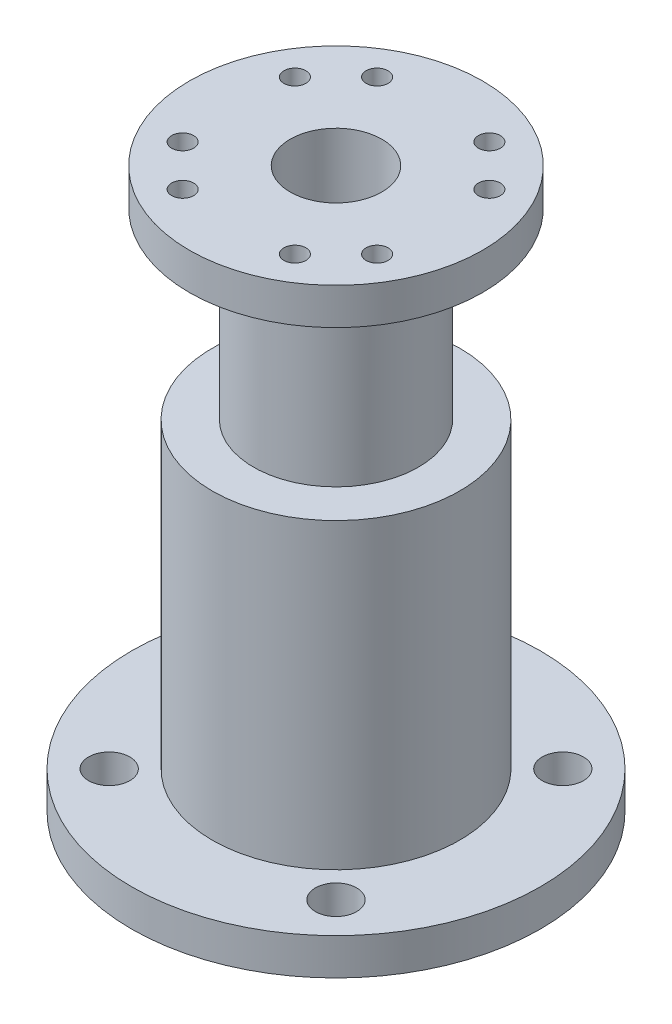
ISO-10303-21;
HEADER;
FILE_DESCRIPTION(('STEP AP214'),'2;1');
FILE_NAME('part.step','',(''),(''),'','','');
FILE_SCHEMA(('AUTOMOTIVE_DESIGN { 1 0 10303 214 1 1 1 1 }'));
ENDSEC;
DATA;
#1=APPLICATION_CONTEXT('core data for automotive mechanical design processes');
#2=APPLICATION_PROTOCOL_DEFINITION('international standard','automotive_design',2000,#1);
#3=PRODUCT_CONTEXT('',#1,'mechanical');
#4=PRODUCT('Part','Part','',(#3));
#5=PRODUCT_RELATED_PRODUCT_CATEGORY('part','',(#4));
#6=PRODUCT_DEFINITION_FORMATION('','',#4);
#7=PRODUCT_DEFINITION_CONTEXT('part definition',#1,'design');
#8=PRODUCT_DEFINITION('design','',#6,#7);
#9=PRODUCT_DEFINITION_SHAPE('','',#8);
#10=(LENGTH_UNIT() NAMED_UNIT(*) SI_UNIT(.MILLI.,.METRE.));
#11=(NAMED_UNIT(*) PLANE_ANGLE_UNIT() SI_UNIT($,.RADIAN.));
#12=(NAMED_UNIT(*) SI_UNIT($,.STERADIAN.) SOLID_ANGLE_UNIT());
#13=UNCERTAINTY_MEASURE_WITH_UNIT(LENGTH_MEASURE(1.E-05),#10,'distance_accuracy_value','');
#14=(GEOMETRIC_REPRESENTATION_CONTEXT(3) GLOBAL_UNCERTAINTY_ASSIGNED_CONTEXT((#13)) GLOBAL_UNIT_ASSIGNED_CONTEXT((#10,
#11,#12)) REPRESENTATION_CONTEXT('',''));
#15=CARTESIAN_POINT('',(0.,0.,0.));
#16=DIRECTION('',(0.,0.,1.));
#17=DIRECTION('',(1.,0.,0.));
#18=AXIS2_PLACEMENT_3D('',#15,#16,#17);
#19=CARTESIAN_POINT('',(0.,0.,0.));
#20=DIRECTION('',(0.,-1.,0.));
#21=DIRECTION('',(0.,0.,-1.));
#22=AXIS2_PLACEMENT_3D('',#19,#20,#21);
#23=CYLINDRICAL_SURFACE('',#22,9.);
#24=CARTESIAN_POINT('',(0.,37.,0.));
#25=DIRECTION('',(0.,-1.,0.));
#26=DIRECTION('',(0.,0.,-1.));
#27=AXIS2_PLACEMENT_3D('',#24,#25,#26);
#28=CIRCLE('',#27,9.00000000000001);
#29=CARTESIAN_POINT('',(0.,37.,-9.00000000000001));
#30=VERTEX_POINT('',#29);
#31=EDGE_CURVE('E41',#30,#30,#28,.T.);
#32=ORIENTED_EDGE('',*,*,#31,.F.);
#33=EDGE_LOOP('',(#32));
#34=FACE_BOUND('',#33,.T.);
#35=CARTESIAN_POINT('',(0.,57.,0.));
#36=DIRECTION('',(0.,1.,0.));
#37=DIRECTION('',(0.,0.,1.));
#38=AXIS2_PLACEMENT_3D('',#35,#36,#37);
#39=CIRCLE('',#38,9.);
#40=CARTESIAN_POINT('',(0.,57.,9.));
#41=VERTEX_POINT('',#40);
#42=EDGE_CURVE('E99',#41,#41,#39,.T.);
#43=ORIENTED_EDGE('',*,*,#42,.F.);
#44=EDGE_LOOP('',(#43));
#45=FACE_BOUND('',#44,.T.);
#46=ADVANCED_FACE('F28',(#34,#45),#23,.T.);
#47=CARTESIAN_POINT('',(0.,0.,0.));
#48=DIRECTION('',(0.,-1.,0.));
#49=DIRECTION('',(0.,0.,-1.));
#50=AXIS2_PLACEMENT_3D('',#47,#48,#49);
#51=CYLINDRICAL_SURFACE('',#50,13.5);
#52=CARTESIAN_POINT('',(0.,37.,0.));
#53=DIRECTION('',(0.,-1.,0.));
#54=DIRECTION('',(0.,0.,-1.));
#55=AXIS2_PLACEMENT_3D('',#52,#53,#54);
#56=CIRCLE('',#55,13.5);
#57=CARTESIAN_POINT('',(0.,37.,-13.5));
#58=VERTEX_POINT('',#57);
#59=EDGE_CURVE('E36',#58,#58,#56,.T.);
#60=ORIENTED_EDGE('',*,*,#59,.T.);
#61=EDGE_LOOP('',(#60));
#62=FACE_BOUND('',#61,.T.);
#63=CARTESIAN_POINT('',(0.,4.,0.));
#64=DIRECTION('',(0.,-1.,0.));
#65=DIRECTION('',(0.,0.,-1.));
#66=AXIS2_PLACEMENT_3D('',#63,#64,#65);
#67=CIRCLE('',#66,13.5);
#68=CARTESIAN_POINT('',(0.,4.,-13.5));
#69=VERTEX_POINT('',#68);
#70=EDGE_CURVE('E48',#69,#69,#67,.T.);
#71=ORIENTED_EDGE('',*,*,#70,.F.);
#72=EDGE_LOOP('',(#71));
#73=FACE_BOUND('',#72,.T.);
#74=ADVANCED_FACE('F95',(#62,#73),#51,.T.);
#75=CARTESIAN_POINT('',(0.,0.,0.));
#76=DIRECTION('',(0.,-1.,0.));
#77=DIRECTION('',(0.,0.,-1.));
#78=AXIS2_PLACEMENT_3D('',#75,#76,#77);
#79=CYLINDRICAL_SURFACE('',#78,9.5);
#80=CARTESIAN_POINT('',(0.,0.,0.));
#81=DIRECTION('',(0.,-1.,0.));
#82=DIRECTION('',(0.,0.,-1.));
#83=AXIS2_PLACEMENT_3D('',#80,#81,#82);
#84=CIRCLE('',#83,9.50000000000001);
#85=CARTESIAN_POINT('',(0.,0.,-9.50000000000001));
#86=VERTEX_POINT('',#85);
#87=EDGE_CURVE('E10',#86,#86,#84,.T.);
#88=ORIENTED_EDGE('',*,*,#87,.T.);
#89=EDGE_LOOP('',(#88));
#90=FACE_BOUND('',#89,.T.);
#91=CARTESIAN_POINT('',(0.,33.,0.));
#92=DIRECTION('',(0.,-1.,0.));
#93=DIRECTION('',(0.,0.,-1.));
#94=AXIS2_PLACEMENT_3D('',#91,#92,#93);
#95=CIRCLE('',#94,9.5);
#96=CARTESIAN_POINT('',(0.,33.,-9.5));
#97=VERTEX_POINT('',#96);
#98=EDGE_CURVE('E77',#97,#97,#95,.T.);
#99=ORIENTED_EDGE('',*,*,#98,.F.);
#100=EDGE_LOOP('',(#99));
#101=FACE_BOUND('',#100,.T.);
#102=ADVANCED_FACE('F30',(#90,#101),#79,.F.);
#103=CARTESIAN_POINT('',(9.50000000000001,0.,0.));
#104=DIRECTION('',(0.,-1.,0.));
#105=DIRECTION('',(0.,0.,-1.));
#106=AXIS2_PLACEMENT_3D('',#103,#104,#105);
#107=PLANE('',#106);
#108=CARTESIAN_POINT('',(-12.3743686707646,0.,12.3743686707646));
#109=DIRECTION('',(0.,-1.,0.));
#110=DIRECTION('',(0.,0.,-1.));
#111=AXIS2_PLACEMENT_3D('',#108,#109,#110);
#112=CIRCLE('',#111,2.24999999999999);
#113=CARTESIAN_POINT('',(-12.3743686707646,0.,10.1243686707646));
#114=VERTEX_POINT('',#113);
#115=EDGE_CURVE('E65',#114,#114,#112,.T.);
#116=ORIENTED_EDGE('',*,*,#115,.F.);
#117=EDGE_LOOP('',(#116));
#118=FACE_BOUND('',#117,.T.);
#119=CARTESIAN_POINT('',(12.3743686707646,0.,12.3743686707646));
#120=DIRECTION('',(0.,-1.,0.));
#121=DIRECTION('',(0.,0.,-1.));
#122=AXIS2_PLACEMENT_3D('',#119,#120,#121);
#123=CIRCLE('',#122,2.24999999999999);
#124=CARTESIAN_POINT('',(12.3743686707646,0.,10.1243686707646));
#125=VERTEX_POINT('',#124);
#126=EDGE_CURVE('E55',#125,#125,#123,.T.);
#127=ORIENTED_EDGE('',*,*,#126,.F.);
#128=EDGE_LOOP('',(#127));
#129=FACE_BOUND('',#128,.T.);
#130=CARTESIAN_POINT('',(12.3743686707646,0.,-12.3743686707646));
#131=DIRECTION('',(0.,-1.,0.));
#132=DIRECTION('',(0.,0.,-1.));
#133=AXIS2_PLACEMENT_3D('',#130,#131,#132);
#134=CIRCLE('',#133,2.24999999999999);
#135=CARTESIAN_POINT('',(12.3743686707646,0.,-14.6243686707646));
#136=VERTEX_POINT('',#135);
#137=EDGE_CURVE('E52',#136,#136,#134,.T.);
#138=ORIENTED_EDGE('',*,*,#137,.F.);
#139=EDGE_LOOP('',(#138));
#140=FACE_BOUND('',#139,.T.);
#141=CARTESIAN_POINT('',(-12.3743686707646,0.,-12.3743686707646));
#142=DIRECTION('',(0.,-1.,0.));
#143=DIRECTION('',(0.,0.,-1.));
#144=AXIS2_PLACEMENT_3D('',#141,#142,#143);
#145=CIRCLE('',#144,2.24999999999999);
#146=CARTESIAN_POINT('',(-12.3743686707646,0.,-14.6243686707646));
#147=VERTEX_POINT('',#146);
#148=EDGE_CURVE('E49',#147,#147,#145,.T.);
#149=ORIENTED_EDGE('',*,*,#148,.F.);
#150=EDGE_LOOP('',(#149));
#151=FACE_BOUND('',#150,.T.);
#152=ORIENTED_EDGE('',*,*,#87,.F.);
#153=EDGE_LOOP('',(#152));
#154=FACE_BOUND('',#153,.T.);
#155=CARTESIAN_POINT('',(0.,0.,0.));
#156=DIRECTION('',(0.,-1.,0.));
#157=DIRECTION('',(0.,0.,-1.));
#158=AXIS2_PLACEMENT_3D('',#155,#156,#157);
#159=CIRCLE('',#158,22.3);
#160=CARTESIAN_POINT('',(0.,0.,-22.3));
#161=VERTEX_POINT('',#160);
#162=EDGE_CURVE('E73',#161,#161,#159,.T.);
#163=ORIENTED_EDGE('',*,*,#162,.T.);
#164=EDGE_LOOP('',(#163));
#165=FACE_BOUND('',#164,.T.);
#166=ADVANCED_FACE('F120',(#118,#129,#140,#151,#154,#165),#107,.T.);
#167=CARTESIAN_POINT('',(9.00000000000001,37.,0.));
#168=DIRECTION('',(0.,1.,0.));
#169=DIRECTION('',(0.,0.,1.));
#170=AXIS2_PLACEMENT_3D('',#167,#168,#169);
#171=PLANE('',#170);
#172=ORIENTED_EDGE('',*,*,#31,.T.);
#173=EDGE_LOOP('',(#172));
#174=FACE_BOUND('',#173,.T.);
#175=ORIENTED_EDGE('',*,*,#59,.F.);
#176=EDGE_LOOP('',(#175));
#177=FACE_BOUND('',#176,.T.);
#178=ADVANCED_FACE('F90',(#174,#177),#171,.T.);
#179=CARTESIAN_POINT('',(5.,61.,0.));
#180=DIRECTION('',(0.,1.,0.));
#181=DIRECTION('',(0.,0.,1.));
#182=AXIS2_PLACEMENT_3D('',#179,#180,#181);
#183=PLANE('',#182);
#184=CARTESIAN_POINT('',(-10.6088111963593,61.,-6.12500000000004));
#185=DIRECTION('',(0.,1.,0.));
#186=DIRECTION('',(0.,0.,1.));
#187=AXIS2_PLACEMENT_3D('',#184,#185,#186);
#188=CIRCLE('',#187,1.2);
#189=CARTESIAN_POINT('',(-10.6088111963593,61.,-4.92500000000004));
#190=VERTEX_POINT('',#189);
#191=EDGE_CURVE('E328',#190,#190,#188,.T.);
#192=ORIENTED_EDGE('',*,*,#191,.F.);
#193=EDGE_LOOP('',(#192));
#194=FACE_BOUND('',#193,.T.);
#195=CARTESIAN_POINT('',(10.6088111963594,61.,-6.12499999999991));
#196=DIRECTION('',(0.,1.,0.));
#197=DIRECTION('',(0.,0.,1.));
#198=AXIS2_PLACEMENT_3D('',#195,#196,#197);
#199=CIRCLE('',#198,1.2);
#200=CARTESIAN_POINT('',(10.6088111963594,61.,-4.92499999999991));
#201=VERTEX_POINT('',#200);
#202=EDGE_CURVE('E330',#201,#201,#199,.T.);
#203=ORIENTED_EDGE('',*,*,#202,.F.);
#204=EDGE_LOOP('',(#203));
#205=FACE_BOUND('',#204,.T.);
#206=CARTESIAN_POINT('',(6.12499999999994,61.,10.6088111963594));
#207=DIRECTION('',(0.,1.,0.));
#208=DIRECTION('',(0.,0.,1.));
#209=AXIS2_PLACEMENT_3D('',#206,#207,#208);
#210=CIRCLE('',#209,1.2);
#211=CARTESIAN_POINT('',(6.12499999999994,61.,11.8088111963594));
#212=VERTEX_POINT('',#211);
#213=EDGE_CURVE('E338',#212,#212,#210,.T.);
#214=ORIENTED_EDGE('',*,*,#213,.F.);
#215=EDGE_LOOP('',(#214));
#216=FACE_BOUND('',#215,.T.);
#217=CARTESIAN_POINT('',(-6.12500000000001,61.,10.6088111963594));
#218=DIRECTION('',(0.,1.,0.));
#219=DIRECTION('',(0.,0.,1.));
#220=AXIS2_PLACEMENT_3D('',#217,#218,#219);
#221=CIRCLE('',#220,1.2);
#222=CARTESIAN_POINT('',(-6.12500000000001,61.,11.8088111963594));
#223=VERTEX_POINT('',#222);
#224=EDGE_CURVE('E344',#223,#223,#221,.T.);
#225=ORIENTED_EDGE('',*,*,#224,.F.);
#226=EDGE_LOOP('',(#225));
#227=FACE_BOUND('',#226,.T.);
#228=CARTESIAN_POINT('',(-10.6088111963594,61.,6.12499999999991));
#229=DIRECTION('',(0.,1.,0.));
#230=DIRECTION('',(0.,0.,1.));
#231=AXIS2_PLACEMENT_3D('',#228,#229,#230);
#232=CIRCLE('',#231,1.2);
#233=CARTESIAN_POINT('',(-10.6088111963594,61.,7.32499999999991));
#234=VERTEX_POINT('',#233);
#235=EDGE_CURVE('E350',#234,#234,#232,.T.);
#236=ORIENTED_EDGE('',*,*,#235,.F.);
#237=EDGE_LOOP('',(#236));
#238=FACE_BOUND('',#237,.T.);
#239=CARTESIAN_POINT('',(-6.12499999999994,61.,-10.6088111963594));
#240=DIRECTION('',(0.,1.,0.));
#241=DIRECTION('',(0.,0.,1.));
#242=AXIS2_PLACEMENT_3D('',#239,#240,#241);
#243=CIRCLE('',#242,1.2);
#244=CARTESIAN_POINT('',(-6.12499999999994,61.,-9.40881119635941));
#245=VERTEX_POINT('',#244);
#246=EDGE_CURVE('E356',#245,#245,#243,.T.);
#247=ORIENTED_EDGE('',*,*,#246,.F.);
#248=EDGE_LOOP('',(#247));
#249=FACE_BOUND('',#248,.T.);
#250=CARTESIAN_POINT('',(6.12500000000001,61.,-10.6088111963594));
#251=DIRECTION('',(0.,1.,0.));
#252=DIRECTION('',(0.,0.,1.));
#253=AXIS2_PLACEMENT_3D('',#250,#251,#252);
#254=CIRCLE('',#253,1.2);
#255=CARTESIAN_POINT('',(6.12500000000001,61.,-9.40881119635937));
#256=VERTEX_POINT('',#255);
#257=EDGE_CURVE('E362',#256,#256,#254,.T.);
#258=ORIENTED_EDGE('',*,*,#257,.F.);
#259=EDGE_LOOP('',(#258));
#260=FACE_BOUND('',#259,.T.);
#261=CARTESIAN_POINT('',(10.6088111963593,61.,6.12500000000004));
#262=DIRECTION('',(0.,1.,0.));
#263=DIRECTION('',(0.,0.,1.));
#264=AXIS2_PLACEMENT_3D('',#261,#262,#263);
#265=CIRCLE('',#264,1.2);
#266=CARTESIAN_POINT('',(10.6088111963593,61.,7.32500000000004));
#267=VERTEX_POINT('',#266);
#268=EDGE_CURVE('E107',#267,#267,#265,.T.);
#269=ORIENTED_EDGE('',*,*,#268,.F.);
#270=EDGE_LOOP('',(#269));
#271=FACE_BOUND('',#270,.T.);
#272=CARTESIAN_POINT('',(0.,61.,0.));
#273=DIRECTION('',(0.,-1.,0.));
#274=DIRECTION('',(0.,0.,-1.));
#275=AXIS2_PLACEMENT_3D('',#272,#273,#274);
#276=CIRCLE('',#275,5.);
#277=CARTESIAN_POINT('',(0.,61.,-5.));
#278=VERTEX_POINT('',#277);
#279=EDGE_CURVE('E85',#278,#278,#276,.T.);
#280=ORIENTED_EDGE('',*,*,#279,.T.);
#281=EDGE_LOOP('',(#280));
#282=FACE_BOUND('',#281,.T.);
#283=CARTESIAN_POINT('',(0.,61.,0.));
#284=DIRECTION('',(0.,1.,0.));
#285=DIRECTION('',(0.,0.,1.));
#286=AXIS2_PLACEMENT_3D('',#283,#284,#285);
#287=CIRCLE('',#286,16.);
#288=CARTESIAN_POINT('',(0.,61.,16.));
#289=VERTEX_POINT('',#288);
#290=EDGE_CURVE('E101',#289,#289,#287,.T.);
#291=ORIENTED_EDGE('',*,*,#290,.T.);
#292=EDGE_LOOP('',(#291));
#293=FACE_BOUND('',#292,.T.);
#294=ADVANCED_FACE('F151',(#194,#205,#216,#227,#238,#249,#260,#271,#282,#293),#183,.T.);
#295=CARTESIAN_POINT('',(0.,0.,0.));
#296=DIRECTION('',(0.,-1.,0.));
#297=DIRECTION('',(0.,0.,-1.));
#298=AXIS2_PLACEMENT_3D('',#295,#296,#297);
#299=CYLINDRICAL_SURFACE('',#298,5.);
#300=CARTESIAN_POINT('',(0.,33.,0.));
#301=DIRECTION('',(0.,-1.,0.));
#302=DIRECTION('',(0.,0.,-1.));
#303=AXIS2_PLACEMENT_3D('',#300,#301,#302);
#304=CIRCLE('',#303,5.);
#305=CARTESIAN_POINT('',(0.,33.,-5.));
#306=VERTEX_POINT('',#305);
#307=EDGE_CURVE('E82',#306,#306,#304,.T.);
#308=ORIENTED_EDGE('',*,*,#307,.T.);
#309=EDGE_LOOP('',(#308));
#310=FACE_BOUND('',#309,.T.);
#311=ORIENTED_EDGE('',*,*,#279,.F.);
#312=EDGE_LOOP('',(#311));
#313=FACE_BOUND('',#312,.T.);
#314=ADVANCED_FACE('F144',(#310,#313),#299,.F.);
#315=CARTESIAN_POINT('',(5.,33.,0.));
#316=DIRECTION('',(0.,-1.,0.));
#317=DIRECTION('',(0.,0.,-1.));
#318=AXIS2_PLACEMENT_3D('',#315,#316,#317);
#319=PLANE('',#318);
#320=ORIENTED_EDGE('',*,*,#98,.T.);
#321=EDGE_LOOP('',(#320));
#322=FACE_BOUND('',#321,.T.);
#323=ORIENTED_EDGE('',*,*,#307,.F.);
#324=EDGE_LOOP('',(#323));
#325=FACE_BOUND('',#324,.T.);
#326=ADVANCED_FACE('F134',(#322,#325),#319,.T.);
#327=CARTESIAN_POINT('',(0.,4.,0.));
#328=DIRECTION('',(0.,-1.,0.));
#329=DIRECTION('',(0.,0.,-1.));
#330=AXIS2_PLACEMENT_3D('',#327,#328,#329);
#331=CYLINDRICAL_SURFACE('',#330,22.3);
#332=CARTESIAN_POINT('',(0.,4.,0.));
#333=DIRECTION('',(0.,-1.,0.));
#334=DIRECTION('',(0.,0.,-1.));
#335=AXIS2_PLACEMENT_3D('',#332,#333,#334);
#336=CIRCLE('',#335,22.3);
#337=CARTESIAN_POINT('',(0.,4.,-22.3));
#338=VERTEX_POINT('',#337);
#339=EDGE_CURVE('E74',#338,#338,#336,.T.);
#340=ORIENTED_EDGE('',*,*,#339,.T.);
#341=EDGE_LOOP('',(#340));
#342=FACE_BOUND('',#341,.T.);
#343=ORIENTED_EDGE('',*,*,#162,.F.);
#344=EDGE_LOOP('',(#343));
#345=FACE_BOUND('',#344,.T.);
#346=ADVANCED_FACE('F131',(#342,#345),#331,.T.);
#347=CARTESIAN_POINT('',(0.,4.,0.));
#348=DIRECTION('',(0.,-1.,0.));
#349=DIRECTION('',(0.,0.,-1.));
#350=AXIS2_PLACEMENT_3D('',#347,#348,#349);
#351=PLANE('',#350);
#352=CARTESIAN_POINT('',(-12.3743686707646,4.,12.3743686707646));
#353=DIRECTION('',(0.,-1.,0.));
#354=DIRECTION('',(0.,0.,-1.));
#355=AXIS2_PLACEMENT_3D('',#352,#353,#354);
#356=CIRCLE('',#355,2.24999999999999);
#357=CARTESIAN_POINT('',(-12.3743686707646,4.,10.1243686707646));
#358=VERTEX_POINT('',#357);
#359=EDGE_CURVE('E32',#358,#358,#356,.T.);
#360=ORIENTED_EDGE('',*,*,#359,.T.);
#361=EDGE_LOOP('',(#360));
#362=FACE_BOUND('',#361,.T.);
#363=CARTESIAN_POINT('',(12.3743686707646,4.,12.3743686707646));
#364=DIRECTION('',(0.,-1.,0.));
#365=DIRECTION('',(0.,0.,-1.));
#366=AXIS2_PLACEMENT_3D('',#363,#364,#365);
#367=CIRCLE('',#366,2.24999999999999);
#368=CARTESIAN_POINT('',(12.3743686707646,4.,10.1243686707646));
#369=VERTEX_POINT('',#368);
#370=EDGE_CURVE('E53',#369,#369,#367,.T.);
#371=ORIENTED_EDGE('',*,*,#370,.T.);
#372=EDGE_LOOP('',(#371));
#373=FACE_BOUND('',#372,.T.);
#374=CARTESIAN_POINT('',(12.3743686707646,4.,-12.3743686707646));
#375=DIRECTION('',(0.,-1.,0.));
#376=DIRECTION('',(0.,0.,-1.));
#377=AXIS2_PLACEMENT_3D('',#374,#375,#376);
#378=CIRCLE('',#377,2.24999999999999);
#379=CARTESIAN_POINT('',(12.3743686707646,4.,-14.6243686707646));
#380=VERTEX_POINT('',#379);
#381=EDGE_CURVE('E50',#380,#380,#378,.T.);
#382=ORIENTED_EDGE('',*,*,#381,.T.);
#383=EDGE_LOOP('',(#382));
#384=FACE_BOUND('',#383,.T.);
#385=CARTESIAN_POINT('',(-12.3743686707646,4.,-12.3743686707646));
#386=DIRECTION('',(0.,-1.,0.));
#387=DIRECTION('',(0.,0.,-1.));
#388=AXIS2_PLACEMENT_3D('',#385,#386,#387);
#389=CIRCLE('',#388,2.24999999999999);
#390=CARTESIAN_POINT('',(-12.3743686707646,4.,-14.6243686707646));
#391=VERTEX_POINT('',#390);
#392=EDGE_CURVE('E45',#391,#391,#389,.T.);
#393=ORIENTED_EDGE('',*,*,#392,.T.);
#394=EDGE_LOOP('',(#393));
#395=FACE_BOUND('',#394,.T.);
#396=ORIENTED_EDGE('',*,*,#70,.T.);
#397=EDGE_LOOP('',(#396));
#398=FACE_BOUND('',#397,.T.);
#399=ORIENTED_EDGE('',*,*,#339,.F.);
#400=EDGE_LOOP('',(#399));
#401=FACE_BOUND('',#400,.T.);
#402=ADVANCED_FACE('F133',(#362,#373,#384,#395,#398,#401),#351,.F.);
#403=CARTESIAN_POINT('',(-12.3743686707646,0.,-12.3743686707646));
#404=DIRECTION('',(0.,-1.,0.));
#405=DIRECTION('',(0.,0.,-1.));
#406=AXIS2_PLACEMENT_3D('',#403,#404,#405);
#407=CYLINDRICAL_SURFACE('',#406,2.24999999999999);
#408=ORIENTED_EDGE('',*,*,#148,.T.);
#409=EDGE_LOOP('',(#408));
#410=FACE_BOUND('',#409,.T.);
#411=ORIENTED_EDGE('',*,*,#392,.F.);
#412=EDGE_LOOP('',(#411));
#413=FACE_BOUND('',#412,.T.);
#414=ADVANCED_FACE('F141',(#410,#413),#407,.F.);
#415=CARTESIAN_POINT('',(12.3743686707646,0.,-12.3743686707646));
#416=DIRECTION('',(0.,-1.,0.));
#417=DIRECTION('',(0.,0.,-1.));
#418=AXIS2_PLACEMENT_3D('',#415,#416,#417);
#419=CYLINDRICAL_SURFACE('',#418,2.24999999999999);
#420=ORIENTED_EDGE('',*,*,#137,.T.);
#421=EDGE_LOOP('',(#420));
#422=FACE_BOUND('',#421,.T.);
#423=ORIENTED_EDGE('',*,*,#381,.F.);
#424=EDGE_LOOP('',(#423));
#425=FACE_BOUND('',#424,.T.);
#426=ADVANCED_FACE('F199',(#422,#425),#419,.F.);
#427=CARTESIAN_POINT('',(12.3743686707646,0.,12.3743686707646));
#428=DIRECTION('',(0.,-1.,0.));
#429=DIRECTION('',(0.,0.,-1.));
#430=AXIS2_PLACEMENT_3D('',#427,#428,#429);
#431=CYLINDRICAL_SURFACE('',#430,2.24999999999999);
#432=ORIENTED_EDGE('',*,*,#126,.T.);
#433=EDGE_LOOP('',(#432));
#434=FACE_BOUND('',#433,.T.);
#435=ORIENTED_EDGE('',*,*,#370,.F.);
#436=EDGE_LOOP('',(#435));
#437=FACE_BOUND('',#436,.T.);
#438=ADVANCED_FACE('F193',(#434,#437),#431,.F.);
#439=CARTESIAN_POINT('',(-12.3743686707646,0.,12.3743686707646));
#440=DIRECTION('',(0.,-1.,0.));
#441=DIRECTION('',(0.,0.,-1.));
#442=AXIS2_PLACEMENT_3D('',#439,#440,#441);
#443=CYLINDRICAL_SURFACE('',#442,2.24999999999999);
#444=ORIENTED_EDGE('',*,*,#115,.T.);
#445=EDGE_LOOP('',(#444));
#446=FACE_BOUND('',#445,.T.);
#447=ORIENTED_EDGE('',*,*,#359,.F.);
#448=EDGE_LOOP('',(#447));
#449=FACE_BOUND('',#448,.T.);
#450=ADVANCED_FACE('F117',(#446,#449),#443,.F.);
#451=CARTESIAN_POINT('',(0.,57.,0.));
#452=DIRECTION('',(0.,1.,0.));
#453=DIRECTION('',(0.,0.,1.));
#454=AXIS2_PLACEMENT_3D('',#451,#452,#453);
#455=CYLINDRICAL_SURFACE('',#454,16.);
#456=CARTESIAN_POINT('',(0.,57.,0.));
#457=DIRECTION('',(0.,1.,0.));
#458=DIRECTION('',(0.,0.,1.));
#459=AXIS2_PLACEMENT_3D('',#456,#457,#458);
#460=CIRCLE('',#459,16.);
#461=CARTESIAN_POINT('',(0.,57.,16.));
#462=VERTEX_POINT('',#461);
#463=EDGE_CURVE('E105',#462,#462,#460,.T.);
#464=ORIENTED_EDGE('',*,*,#463,.T.);
#465=EDGE_LOOP('',(#464));
#466=FACE_BOUND('',#465,.T.);
#467=ORIENTED_EDGE('',*,*,#290,.F.);
#468=EDGE_LOOP('',(#467));
#469=FACE_BOUND('',#468,.T.);
#470=ADVANCED_FACE('F181',(#466,#469),#455,.T.);
#471=CARTESIAN_POINT('',(0.,57.,0.));
#472=DIRECTION('',(0.,1.,0.));
#473=DIRECTION('',(0.,0.,1.));
#474=AXIS2_PLACEMENT_3D('',#471,#472,#473);
#475=PLANE('',#474);
#476=CARTESIAN_POINT('',(-10.6088111963593,57.,-6.12500000000004));
#477=DIRECTION('',(0.,1.,0.));
#478=DIRECTION('',(0.,0.,1.));
#479=AXIS2_PLACEMENT_3D('',#476,#477,#478);
#480=CIRCLE('',#479,1.2);
#481=CARTESIAN_POINT('',(-10.6088111963593,57.,-4.92500000000004));
#482=VERTEX_POINT('',#481);
#483=EDGE_CURVE('E325',#482,#482,#480,.T.);
#484=ORIENTED_EDGE('',*,*,#483,.T.);
#485=EDGE_LOOP('',(#484));
#486=FACE_BOUND('',#485,.T.);
#487=CARTESIAN_POINT('',(10.6088111963594,57.,-6.12499999999991));
#488=DIRECTION('',(0.,1.,0.));
#489=DIRECTION('',(0.,0.,1.));
#490=AXIS2_PLACEMENT_3D('',#487,#488,#489);
#491=CIRCLE('',#490,1.2);
#492=CARTESIAN_POINT('',(10.6088111963594,57.,-4.92499999999991));
#493=VERTEX_POINT('',#492);
#494=EDGE_CURVE('E335',#493,#493,#491,.T.);
#495=ORIENTED_EDGE('',*,*,#494,.T.);
#496=EDGE_LOOP('',(#495));
#497=FACE_BOUND('',#496,.T.);
#498=CARTESIAN_POINT('',(6.12499999999994,57.,10.6088111963594));
#499=DIRECTION('',(0.,1.,0.));
#500=DIRECTION('',(0.,0.,1.));
#501=AXIS2_PLACEMENT_3D('',#498,#499,#500);
#502=CIRCLE('',#501,1.2);
#503=CARTESIAN_POINT('',(6.12499999999994,57.,11.8088111963594));
#504=VERTEX_POINT('',#503);
#505=EDGE_CURVE('E341',#504,#504,#502,.T.);
#506=ORIENTED_EDGE('',*,*,#505,.T.);
#507=EDGE_LOOP('',(#506));
#508=FACE_BOUND('',#507,.T.);
#509=CARTESIAN_POINT('',(-6.12500000000001,57.,10.6088111963594));
#510=DIRECTION('',(0.,1.,0.));
#511=DIRECTION('',(0.,0.,1.));
#512=AXIS2_PLACEMENT_3D('',#509,#510,#511);
#513=CIRCLE('',#512,1.2);
#514=CARTESIAN_POINT('',(-6.12500000000001,57.,11.8088111963594));
#515=VERTEX_POINT('',#514);
#516=EDGE_CURVE('E347',#515,#515,#513,.T.);
#517=ORIENTED_EDGE('',*,*,#516,.T.);
#518=EDGE_LOOP('',(#517));
#519=FACE_BOUND('',#518,.T.);
#520=CARTESIAN_POINT('',(-10.6088111963594,57.,6.12499999999991));
#521=DIRECTION('',(0.,1.,0.));
#522=DIRECTION('',(0.,0.,1.));
#523=AXIS2_PLACEMENT_3D('',#520,#521,#522);
#524=CIRCLE('',#523,1.2);
#525=CARTESIAN_POINT('',(-10.6088111963594,57.,7.32499999999991));
#526=VERTEX_POINT('',#525);
#527=EDGE_CURVE('E353',#526,#526,#524,.T.);
#528=ORIENTED_EDGE('',*,*,#527,.T.);
#529=EDGE_LOOP('',(#528));
#530=FACE_BOUND('',#529,.T.);
#531=CARTESIAN_POINT('',(-6.12499999999994,57.,-10.6088111963594));
#532=DIRECTION('',(0.,1.,0.));
#533=DIRECTION('',(0.,0.,1.));
#534=AXIS2_PLACEMENT_3D('',#531,#532,#533);
#535=CIRCLE('',#534,1.2);
#536=CARTESIAN_POINT('',(-6.12499999999994,57.,-9.40881119635941));
#537=VERTEX_POINT('',#536);
#538=EDGE_CURVE('E359',#537,#537,#535,.T.);
#539=ORIENTED_EDGE('',*,*,#538,.T.);
#540=EDGE_LOOP('',(#539));
#541=FACE_BOUND('',#540,.T.);
#542=CARTESIAN_POINT('',(6.12500000000001,57.,-10.6088111963594));
#543=DIRECTION('',(0.,1.,0.));
#544=DIRECTION('',(0.,0.,1.));
#545=AXIS2_PLACEMENT_3D('',#542,#543,#544);
#546=CIRCLE('',#545,1.2);
#547=CARTESIAN_POINT('',(6.12500000000001,57.,-9.40881119635937));
#548=VERTEX_POINT('',#547);
#549=EDGE_CURVE('E365',#548,#548,#546,.T.);
#550=ORIENTED_EDGE('',*,*,#549,.T.);
#551=EDGE_LOOP('',(#550));
#552=FACE_BOUND('',#551,.T.);
#553=CARTESIAN_POINT('',(10.6088111963593,57.,6.12500000000004));
#554=DIRECTION('',(0.,1.,0.));
#555=DIRECTION('',(0.,0.,1.));
#556=AXIS2_PLACEMENT_3D('',#553,#554,#555);
#557=CIRCLE('',#556,1.2);
#558=CARTESIAN_POINT('',(10.6088111963593,57.,7.32500000000004));
#559=VERTEX_POINT('',#558);
#560=EDGE_CURVE('E102',#559,#559,#557,.T.);
#561=ORIENTED_EDGE('',*,*,#560,.T.);
#562=EDGE_LOOP('',(#561));
#563=FACE_BOUND('',#562,.T.);
#564=ORIENTED_EDGE('',*,*,#42,.T.);
#565=EDGE_LOOP('',(#564));
#566=FACE_BOUND('',#565,.T.);
#567=ORIENTED_EDGE('',*,*,#463,.F.);
#568=EDGE_LOOP('',(#567));
#569=FACE_BOUND('',#568,.T.);
#570=ADVANCED_FACE('F183',(#486,#497,#508,#519,#530,#541,#552,#563,#566,#569),#475,.F.);
#571=CARTESIAN_POINT('',(10.6088111963593,61.,6.12500000000004));
#572=DIRECTION('',(0.,1.,0.));
#573=DIRECTION('',(0.,0.,1.));
#574=AXIS2_PLACEMENT_3D('',#571,#572,#573);
#575=CYLINDRICAL_SURFACE('',#574,1.2);
#576=ORIENTED_EDGE('',*,*,#560,.F.);
#577=EDGE_LOOP('',(#576));
#578=FACE_BOUND('',#577,.T.);
#579=ORIENTED_EDGE('',*,*,#268,.T.);
#580=EDGE_LOOP('',(#579));
#581=FACE_BOUND('',#580,.T.);
#582=ADVANCED_FACE('F190',(#578,#581),#575,.F.);
#583=CARTESIAN_POINT('',(6.12500000000001,61.,-10.6088111963594));
#584=DIRECTION('',(0.,1.,0.));
#585=DIRECTION('',(0.,0.,1.));
#586=AXIS2_PLACEMENT_3D('',#583,#584,#585);
#587=CYLINDRICAL_SURFACE('',#586,1.2);
#588=ORIENTED_EDGE('',*,*,#549,.F.);
#589=EDGE_LOOP('',(#588));
#590=FACE_BOUND('',#589,.T.);
#591=ORIENTED_EDGE('',*,*,#257,.T.);
#592=EDGE_LOOP('',(#591));
#593=FACE_BOUND('',#592,.T.);
#594=ADVANCED_FACE('F249',(#590,#593),#587,.F.);
#595=CARTESIAN_POINT('',(-6.12499999999994,61.,-10.6088111963594));
#596=DIRECTION('',(0.,1.,0.));
#597=DIRECTION('',(0.,0.,1.));
#598=AXIS2_PLACEMENT_3D('',#595,#596,#597);
#599=CYLINDRICAL_SURFACE('',#598,1.2);
#600=ORIENTED_EDGE('',*,*,#538,.F.);
#601=EDGE_LOOP('',(#600));
#602=FACE_BOUND('',#601,.T.);
#603=ORIENTED_EDGE('',*,*,#246,.T.);
#604=EDGE_LOOP('',(#603));
#605=FACE_BOUND('',#604,.T.);
#606=ADVANCED_FACE('F258',(#602,#605),#599,.F.);
#607=CARTESIAN_POINT('',(-10.6088111963594,61.,6.12499999999991));
#608=DIRECTION('',(0.,1.,0.));
#609=DIRECTION('',(0.,0.,1.));
#610=AXIS2_PLACEMENT_3D('',#607,#608,#609);
#611=CYLINDRICAL_SURFACE('',#610,1.2);
#612=ORIENTED_EDGE('',*,*,#527,.F.);
#613=EDGE_LOOP('',(#612));
#614=FACE_BOUND('',#613,.T.);
#615=ORIENTED_EDGE('',*,*,#235,.T.);
#616=EDGE_LOOP('',(#615));
#617=FACE_BOUND('',#616,.T.);
#618=ADVANCED_FACE('F268',(#614,#617),#611,.F.);
#619=CARTESIAN_POINT('',(-6.12500000000001,61.,10.6088111963594));
#620=DIRECTION('',(0.,1.,0.));
#621=DIRECTION('',(0.,0.,1.));
#622=AXIS2_PLACEMENT_3D('',#619,#620,#621);
#623=CYLINDRICAL_SURFACE('',#622,1.2);
#624=ORIENTED_EDGE('',*,*,#516,.F.);
#625=EDGE_LOOP('',(#624));
#626=FACE_BOUND('',#625,.T.);
#627=ORIENTED_EDGE('',*,*,#224,.T.);
#628=EDGE_LOOP('',(#627));
#629=FACE_BOUND('',#628,.T.);
#630=ADVANCED_FACE('F278',(#626,#629),#623,.F.);
#631=CARTESIAN_POINT('',(6.12499999999994,61.,10.6088111963594));
#632=DIRECTION('',(0.,1.,0.));
#633=DIRECTION('',(0.,0.,1.));
#634=AXIS2_PLACEMENT_3D('',#631,#632,#633);
#635=CYLINDRICAL_SURFACE('',#634,1.2);
#636=ORIENTED_EDGE('',*,*,#505,.F.);
#637=EDGE_LOOP('',(#636));
#638=FACE_BOUND('',#637,.T.);
#639=ORIENTED_EDGE('',*,*,#213,.T.);
#640=EDGE_LOOP('',(#639));
#641=FACE_BOUND('',#640,.T.);
#642=ADVANCED_FACE('F288',(#638,#641),#635,.F.);
#643=CARTESIAN_POINT('',(10.6088111963594,61.,-6.12499999999991));
#644=DIRECTION('',(0.,1.,0.));
#645=DIRECTION('',(0.,0.,1.));
#646=AXIS2_PLACEMENT_3D('',#643,#644,#645);
#647=CYLINDRICAL_SURFACE('',#646,1.2);
#648=ORIENTED_EDGE('',*,*,#494,.F.);
#649=EDGE_LOOP('',(#648));
#650=FACE_BOUND('',#649,.T.);
#651=ORIENTED_EDGE('',*,*,#202,.T.);
#652=EDGE_LOOP('',(#651));
#653=FACE_BOUND('',#652,.T.);
#654=ADVANCED_FACE('F298',(#650,#653),#647,.F.);
#655=CARTESIAN_POINT('',(-10.6088111963593,61.,-6.12500000000004));
#656=DIRECTION('',(0.,1.,0.));
#657=DIRECTION('',(0.,0.,1.));
#658=AXIS2_PLACEMENT_3D('',#655,#656,#657);
#659=CYLINDRICAL_SURFACE('',#658,1.2);
#660=ORIENTED_EDGE('',*,*,#483,.F.);
#661=EDGE_LOOP('',(#660));
#662=FACE_BOUND('',#661,.T.);
#663=ORIENTED_EDGE('',*,*,#191,.T.);
#664=EDGE_LOOP('',(#663));
#665=FACE_BOUND('',#664,.T.);
#666=ADVANCED_FACE('F308',(#662,#665),#659,.F.);
#667=CLOSED_SHELL('',(#46,#74,#102,#166,#178,#294,#314,#326,#346,#402,#414,#426,#438,#450,#470,
#570,#582,#594,#606,#618,#630,#642,#654,#666));
#668=MANIFOLD_SOLID_BREP('B2',#667);
#669=ADVANCED_BREP_SHAPE_REPRESENTATION('',(#18,#668),#14);
#670=SHAPE_DEFINITION_REPRESENTATION(#9,#669);
ENDSEC;
END-ISO-10303-21;
